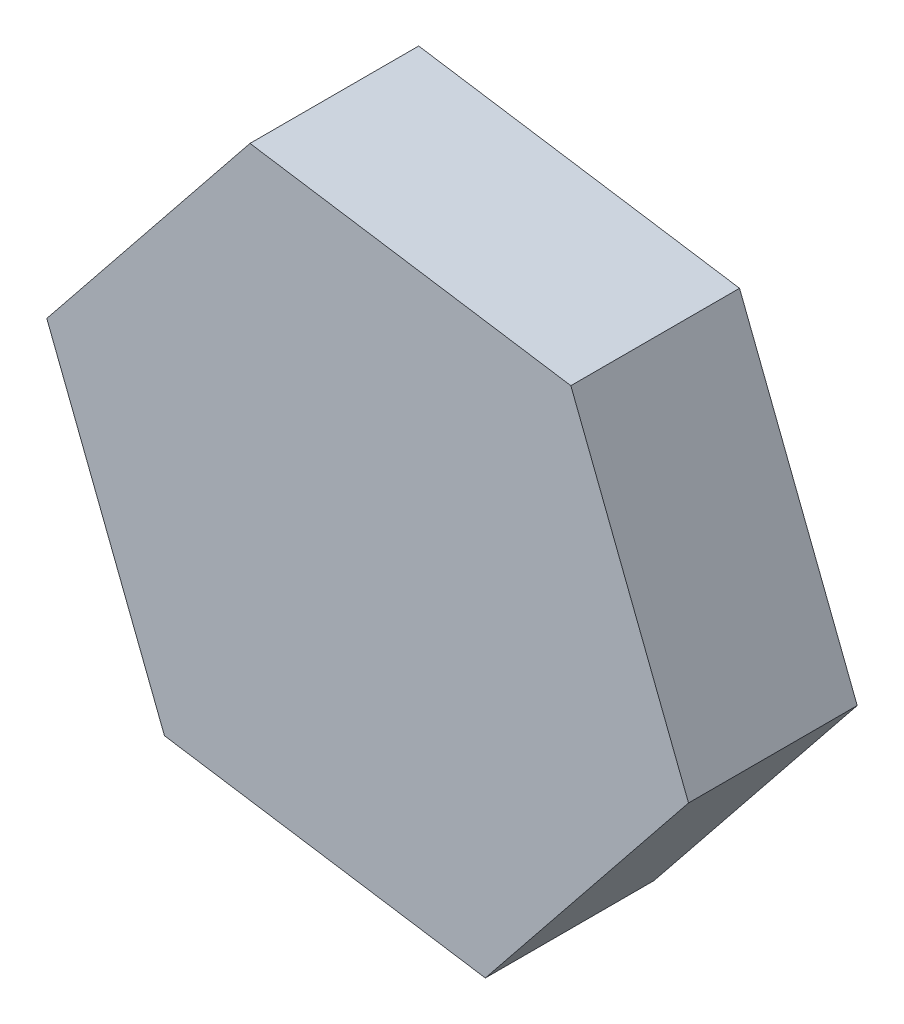
ISO-10303-21;
HEADER;
FILE_DESCRIPTION(('STEP AP214'),'2;1');
FILE_NAME('part.step','',(''),(''),'','','');
FILE_SCHEMA(('AUTOMOTIVE_DESIGN { 1 0 10303 214 1 1 1 1 }'));
ENDSEC;
DATA;
#1=APPLICATION_CONTEXT('core data for automotive mechanical design processes');
#2=APPLICATION_PROTOCOL_DEFINITION('international standard','automotive_design',2000,#1);
#3=PRODUCT_CONTEXT('',#1,'mechanical');
#4=PRODUCT('Part','Part','',(#3));
#5=PRODUCT_RELATED_PRODUCT_CATEGORY('part','',(#4));
#6=PRODUCT_DEFINITION_FORMATION('','',#4);
#7=PRODUCT_DEFINITION_CONTEXT('part definition',#1,'design');
#8=PRODUCT_DEFINITION('design','',#6,#7);
#9=PRODUCT_DEFINITION_SHAPE('','',#8);
#10=(LENGTH_UNIT() NAMED_UNIT(*) SI_UNIT(.MILLI.,.METRE.));
#11=(NAMED_UNIT(*) PLANE_ANGLE_UNIT() SI_UNIT($,.RADIAN.));
#12=(NAMED_UNIT(*) SI_UNIT($,.STERADIAN.) SOLID_ANGLE_UNIT());
#13=UNCERTAINTY_MEASURE_WITH_UNIT(LENGTH_MEASURE(1.E-05),#10,'distance_accuracy_value','');
#14=(GEOMETRIC_REPRESENTATION_CONTEXT(3) GLOBAL_UNCERTAINTY_ASSIGNED_CONTEXT((#13)) GLOBAL_UNIT_ASSIGNED_CONTEXT((#10,
#11,#12)) REPRESENTATION_CONTEXT('',''));
#15=CARTESIAN_POINT('',(0.,0.,0.));
#16=DIRECTION('',(0.,0.,1.));
#17=DIRECTION('',(1.,0.,0.));
#18=AXIS2_PLACEMENT_3D('',#15,#16,#17);
#19=CARTESIAN_POINT('',(-60.0929519376663,5.17809821649077,3.));
#20=DIRECTION('',(0.152114666103763,0.98836285257801,0.));
#21=DIRECTION('',(-0.98836285257801,0.152114666103763,0.));
#22=AXIS2_PLACEMENT_3D('',#19,#20,#21);
#23=PLANE('',#22);
#24=DIRECTION('',(0.98836285257801,-0.152114666103763,0.));
#25=VECTOR('',#24,1.);
#26=CARTESIAN_POINT('',(-60.0929519376663,5.17809821649077,0.));
#27=LINE('',#26,#25);
#28=CARTESIAN_POINT('',(-60.0929519376663,5.17809821649077,0.));
#29=VERTEX_POINT('',#28);
#30=CARTESIAN_POINT('',(-54.3866363477368,4.2998637822638,0.));
#31=VERTEX_POINT('',#30);
#32=EDGE_CURVE('E117',#29,#31,#27,.T.);
#33=ORIENTED_EDGE('',*,*,#32,.T.);
#34=DIRECTION('',(0.,0.,-1.));
#35=VECTOR('',#34,1.);
#36=CARTESIAN_POINT('',(-54.3866363477368,4.2998637822638,3.));
#37=LINE('',#36,#35);
#38=CARTESIAN_POINT('',(-54.3866363477368,4.2998637822638,3.));
#39=VERTEX_POINT('',#38);
#40=EDGE_CURVE('E11',#39,#31,#37,.T.);
#41=ORIENTED_EDGE('',*,*,#40,.F.);
#42=DIRECTION('',(0.98836285257801,-0.152114666103763,0.));
#43=VECTOR('',#42,1.);
#44=CARTESIAN_POINT('',(-60.0929519376663,5.17809821649077,3.));
#45=LINE('',#44,#43);
#46=CARTESIAN_POINT('',(-60.0929519376663,5.17809821649077,3.));
#47=VERTEX_POINT('',#46);
#48=EDGE_CURVE('E127',#47,#39,#45,.T.);
#49=ORIENTED_EDGE('',*,*,#48,.F.);
#50=DIRECTION('',(0.,0.,-1.));
#51=VECTOR('',#50,1.);
#52=CARTESIAN_POINT('',(-60.0929519376663,5.17809821649077,3.));
#53=LINE('',#52,#51);
#54=EDGE_CURVE('E113',#47,#29,#53,.T.);
#55=ORIENTED_EDGE('',*,*,#54,.T.);
#56=EDGE_LOOP('',(#33,#41,#49,#55));
#57=FACE_BOUND('',#56,.T.);
#58=ADVANCED_FACE('F33',(#57),#23,.F.);
#59=CARTESIAN_POINT('',(-54.3866363477368,4.2998637822638,3.));
#60=DIRECTION('',(-0.779890005437529,0.625916591423051,0.));
#61=DIRECTION('',(-0.625916591423052,-0.779890005437529,0.));
#62=AXIS2_PLACEMENT_3D('',#59,#60,#61);
#63=PLANE('',#62);
#64=DIRECTION('',(0.625916591423051,0.779890005437529,0.));
#65=VECTOR('',#64,1.);
#66=CARTESIAN_POINT('',(-54.3866363477368,4.2998637822638,0.));
#67=LINE('',#66,#65);
#68=CARTESIAN_POINT('',(-50.7729052222533,8.80256082804037,0.));
#69=VERTEX_POINT('',#68);
#70=EDGE_CURVE('E120',#31,#69,#67,.T.);
#71=ORIENTED_EDGE('',*,*,#70,.T.);
#72=DIRECTION('',(0.,0.,-1.));
#73=VECTOR('',#72,1.);
#74=CARTESIAN_POINT('',(-50.7729052222533,8.80256082804037,3.));
#75=LINE('',#74,#73);
#76=CARTESIAN_POINT('',(-50.7729052222533,8.80256082804037,3.));
#77=VERTEX_POINT('',#76);
#78=EDGE_CURVE('E41',#77,#69,#75,.T.);
#79=ORIENTED_EDGE('',*,*,#78,.F.);
#80=DIRECTION('',(0.625916591423051,0.779890005437529,0.));
#81=VECTOR('',#80,1.);
#82=CARTESIAN_POINT('',(-54.3866363477368,4.2998637822638,3.));
#83=LINE('',#82,#81);
#84=EDGE_CURVE('E86',#39,#77,#83,.T.);
#85=ORIENTED_EDGE('',*,*,#84,.F.);
#86=ORIENTED_EDGE('',*,*,#40,.T.);
#87=EDGE_LOOP('',(#71,#79,#85,#86));
#88=FACE_BOUND('',#87,.T.);
#89=ADVANCED_FACE('F151',(#88),#63,.F.);
#90=CARTESIAN_POINT('',(-50.7729052222533,8.80256082804037,3.));
#91=DIRECTION('',(-0.932004671541292,-0.362446261154959,0.));
#92=DIRECTION('',(0.362446261154959,-0.932004671541292,0.));
#93=AXIS2_PLACEMENT_3D('',#90,#91,#92);
#94=PLANE('',#93);
#95=DIRECTION('',(-0.362446261154959,0.932004671541292,0.));
#96=VECTOR('',#95,1.);
#97=CARTESIAN_POINT('',(-50.7729052222533,8.80256082804037,0.));
#98=LINE('',#97,#96);
#99=CARTESIAN_POINT('',(-52.8654896866992,14.1834923080439,0.));
#100=VERTEX_POINT('',#99);
#101=EDGE_CURVE('E122',#69,#100,#98,.T.);
#102=ORIENTED_EDGE('',*,*,#101,.T.);
#103=DIRECTION('',(0.,0.,-1.));
#104=VECTOR('',#103,1.);
#105=CARTESIAN_POINT('',(-52.8654896866992,14.1834923080439,3.));
#106=LINE('',#105,#104);
#107=CARTESIAN_POINT('',(-52.8654896866992,14.1834923080439,3.));
#108=VERTEX_POINT('',#107);
#109=EDGE_CURVE('E108',#108,#100,#106,.T.);
#110=ORIENTED_EDGE('',*,*,#109,.F.);
#111=DIRECTION('',(-0.362446261154959,0.932004671541292,0.));
#112=VECTOR('',#111,1.);
#113=CARTESIAN_POINT('',(-50.7729052222533,8.80256082804037,3.));
#114=LINE('',#113,#112);
#115=EDGE_CURVE('E99',#77,#108,#114,.T.);
#116=ORIENTED_EDGE('',*,*,#115,.F.);
#117=ORIENTED_EDGE('',*,*,#78,.T.);
#118=EDGE_LOOP('',(#102,#110,#116,#117));
#119=FACE_BOUND('',#118,.T.);
#120=ADVANCED_FACE('F133',(#119),#94,.F.);
#121=CARTESIAN_POINT('',(-52.8654896866992,14.1834923080439,3.));
#122=DIRECTION('',(-0.152114666103762,-0.98836285257801,0.));
#123=DIRECTION('',(0.98836285257801,-0.152114666103762,0.));
#124=AXIS2_PLACEMENT_3D('',#121,#122,#123);
#125=PLANE('',#124);
#126=DIRECTION('',(-0.98836285257801,0.152114666103762,0.));
#127=VECTOR('',#126,1.);
#128=CARTESIAN_POINT('',(-52.8654896866992,14.1834923080439,0.));
#129=LINE('',#128,#127);
#130=CARTESIAN_POINT('',(-58.5718052766286,15.0617267422709,0.));
#131=VERTEX_POINT('',#130);
#132=EDGE_CURVE('E107',#100,#131,#129,.T.);
#133=ORIENTED_EDGE('',*,*,#132,.T.);
#134=DIRECTION('',(0.,0.,-1.));
#135=VECTOR('',#134,1.);
#136=CARTESIAN_POINT('',(-58.5718052766286,15.0617267422709,3.));
#137=LINE('',#136,#135);
#138=CARTESIAN_POINT('',(-58.5718052766286,15.0617267422709,3.));
#139=VERTEX_POINT('',#138);
#140=EDGE_CURVE('E104',#139,#131,#137,.T.);
#141=ORIENTED_EDGE('',*,*,#140,.F.);
#142=DIRECTION('',(-0.98836285257801,0.152114666103762,0.));
#143=VECTOR('',#142,1.);
#144=CARTESIAN_POINT('',(-52.8654896866992,14.1834923080439,3.));
#145=LINE('',#144,#143);
#146=EDGE_CURVE('E93',#108,#139,#145,.T.);
#147=ORIENTED_EDGE('',*,*,#146,.F.);
#148=ORIENTED_EDGE('',*,*,#109,.T.);
#149=EDGE_LOOP('',(#133,#141,#147,#148));
#150=FACE_BOUND('',#149,.T.);
#151=ADVANCED_FACE('F105',(#150),#125,.F.);
#152=CARTESIAN_POINT('',(-58.5718052766286,15.0617267422709,3.));
#153=DIRECTION('',(0.779890005437529,-0.625916591423051,0.));
#154=DIRECTION('',(0.625916591423051,0.779890005437529,0.));
#155=AXIS2_PLACEMENT_3D('',#152,#153,#154);
#156=PLANE('',#155);
#157=DIRECTION('',(-0.625916591423051,-0.779890005437529,0.));
#158=VECTOR('',#157,1.);
#159=CARTESIAN_POINT('',(-58.5718052766286,15.0617267422709,0.));
#160=LINE('',#159,#158);
#161=CARTESIAN_POINT('',(-62.1855364021122,10.5590296964943,0.));
#162=VERTEX_POINT('',#161);
#163=EDGE_CURVE('E72',#131,#162,#160,.T.);
#164=ORIENTED_EDGE('',*,*,#163,.T.);
#165=DIRECTION('',(0.,0.,-1.));
#166=VECTOR('',#165,1.);
#167=CARTESIAN_POINT('',(-62.1855364021122,10.5590296964943,3.));
#168=LINE('',#167,#166);
#169=CARTESIAN_POINT('',(-62.1855364021122,10.5590296964943,3.));
#170=VERTEX_POINT('',#169);
#171=EDGE_CURVE('E109',#170,#162,#168,.T.);
#172=ORIENTED_EDGE('',*,*,#171,.F.);
#173=DIRECTION('',(-0.625916591423051,-0.779890005437529,0.));
#174=VECTOR('',#173,1.);
#175=CARTESIAN_POINT('',(-58.5718052766286,15.0617267422709,3.));
#176=LINE('',#175,#174);
#177=EDGE_CURVE('E97',#139,#170,#176,.T.);
#178=ORIENTED_EDGE('',*,*,#177,.F.);
#179=ORIENTED_EDGE('',*,*,#140,.T.);
#180=EDGE_LOOP('',(#164,#172,#178,#179));
#181=FACE_BOUND('',#180,.T.);
#182=ADVANCED_FACE('F111',(#181),#156,.F.);
#183=CARTESIAN_POINT('',(-62.1855364021122,10.5590296964943,3.));
#184=DIRECTION('',(0.932004671541292,0.362446261154959,0.));
#185=DIRECTION('',(-0.362446261154959,0.932004671541292,0.));
#186=AXIS2_PLACEMENT_3D('',#183,#184,#185);
#187=PLANE('',#186);
#188=DIRECTION('',(0.362446261154959,-0.932004671541292,0.));
#189=VECTOR('',#188,1.);
#190=CARTESIAN_POINT('',(-62.1855364021122,10.5590296964943,0.));
#191=LINE('',#190,#189);
#192=EDGE_CURVE('E78',#162,#29,#191,.T.);
#193=ORIENTED_EDGE('',*,*,#192,.T.);
#194=ORIENTED_EDGE('',*,*,#54,.F.);
#195=DIRECTION('',(0.362446261154959,-0.932004671541292,0.));
#196=VECTOR('',#195,1.);
#197=CARTESIAN_POINT('',(-62.1855364021122,10.5590296964943,3.));
#198=LINE('',#197,#196);
#199=EDGE_CURVE('E49',#170,#47,#198,.T.);
#200=ORIENTED_EDGE('',*,*,#199,.F.);
#201=ORIENTED_EDGE('',*,*,#171,.T.);
#202=EDGE_LOOP('',(#193,#194,#200,#201));
#203=FACE_BOUND('',#202,.T.);
#204=ADVANCED_FACE('F140',(#203),#187,.F.);
#205=CARTESIAN_POINT('',(0.,0.,3.));
#206=DIRECTION('',(0.,0.,1.));
#207=DIRECTION('',(1.,0.,0.));
#208=AXIS2_PLACEMENT_3D('',#205,#206,#207);
#209=PLANE('',#208);
#210=ORIENTED_EDGE('',*,*,#48,.T.);
#211=ORIENTED_EDGE('',*,*,#84,.T.);
#212=ORIENTED_EDGE('',*,*,#115,.T.);
#213=ORIENTED_EDGE('',*,*,#146,.T.);
#214=ORIENTED_EDGE('',*,*,#177,.T.);
#215=ORIENTED_EDGE('',*,*,#199,.T.);
#216=EDGE_LOOP('',(#210,#211,#212,#213,#214,#215));
#217=FACE_BOUND('',#216,.T.);
#218=ADVANCED_FACE('F95',(#217),#209,.T.);
#219=CARTESIAN_POINT('',(0.,0.,0.));
#220=DIRECTION('',(0.,0.,1.));
#221=DIRECTION('',(1.,0.,0.));
#222=AXIS2_PLACEMENT_3D('',#219,#220,#221);
#223=PLANE('',#222);
#224=ORIENTED_EDGE('',*,*,#32,.F.);
#225=ORIENTED_EDGE('',*,*,#192,.F.);
#226=ORIENTED_EDGE('',*,*,#163,.F.);
#227=ORIENTED_EDGE('',*,*,#132,.F.);
#228=ORIENTED_EDGE('',*,*,#101,.F.);
#229=ORIENTED_EDGE('',*,*,#70,.F.);
#230=EDGE_LOOP('',(#224,#225,#226,#227,#228,#229));
#231=FACE_BOUND('',#230,.T.);
#232=ADVANCED_FACE('F136',(#231),#223,.F.);
#233=CLOSED_SHELL('',(#58,#89,#120,#151,#182,#204,#218,#232));
#234=MANIFOLD_SOLID_BREP('B2',#233);
#235=ADVANCED_BREP_SHAPE_REPRESENTATION('',(#18,#234),#14);
#236=SHAPE_DEFINITION_REPRESENTATION(#9,#235);
ENDSEC;
END-ISO-10303-21;
